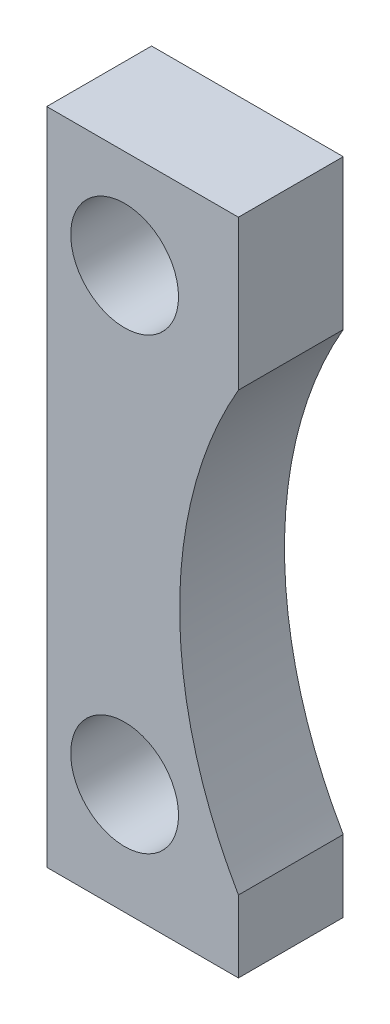
ISO-10303-21;
HEADER;
FILE_DESCRIPTION(('STEP AP214'),'2;1');
FILE_NAME('part.step','',(''),(''),'','','');
FILE_SCHEMA(('AUTOMOTIVE_DESIGN { 1 0 10303 214 1 1 1 1 }'));
ENDSEC;
DATA;
#1=APPLICATION_CONTEXT('core data for automotive mechanical design processes');
#2=APPLICATION_PROTOCOL_DEFINITION('international standard','automotive_design',2000,#1);
#3=PRODUCT_CONTEXT('',#1,'mechanical');
#4=PRODUCT('Part','Part','',(#3));
#5=PRODUCT_RELATED_PRODUCT_CATEGORY('part','',(#4));
#6=PRODUCT_DEFINITION_FORMATION('','',#4);
#7=PRODUCT_DEFINITION_CONTEXT('part definition',#1,'design');
#8=PRODUCT_DEFINITION('design','',#6,#7);
#9=PRODUCT_DEFINITION_SHAPE('','',#8);
#10=(LENGTH_UNIT() NAMED_UNIT(*) SI_UNIT(.MILLI.,.METRE.));
#11=(NAMED_UNIT(*) PLANE_ANGLE_UNIT() SI_UNIT($,.RADIAN.));
#12=(NAMED_UNIT(*) SI_UNIT($,.STERADIAN.) SOLID_ANGLE_UNIT());
#13=UNCERTAINTY_MEASURE_WITH_UNIT(LENGTH_MEASURE(1.E-05),#10,'distance_accuracy_value','');
#14=(GEOMETRIC_REPRESENTATION_CONTEXT(3) GLOBAL_UNCERTAINTY_ASSIGNED_CONTEXT((#13)) GLOBAL_UNIT_ASSIGNED_CONTEXT((#10,
#11,#12)) REPRESENTATION_CONTEXT('',''));
#15=CARTESIAN_POINT('',(0.,0.,0.));
#16=DIRECTION('',(0.,0.,1.));
#17=DIRECTION('',(1.,0.,0.));
#18=AXIS2_PLACEMENT_3D('',#15,#16,#17);
#19=CARTESIAN_POINT('',(0.,0.,8.75));
#20=DIRECTION('',(0.,1.,0.));
#21=DIRECTION('',(0.,0.,1.));
#22=AXIS2_PLACEMENT_3D('',#19,#20,#21);
#23=PLANE('',#22);
#24=DIRECTION('',(1.,0.,0.));
#25=VECTOR('',#24,1.);
#26=CARTESIAN_POINT('',(0.,0.,-8.75));
#27=LINE('',#26,#25);
#28=CARTESIAN_POINT('',(0.,0.,-8.75));
#29=VERTEX_POINT('',#28);
#30=CARTESIAN_POINT('',(32.,0.,-8.75));
#31=VERTEX_POINT('',#30);
#32=EDGE_CURVE('E118',#29,#31,#27,.T.);
#33=ORIENTED_EDGE('',*,*,#32,.T.);
#34=DIRECTION('',(0.,0.,-1.));
#35=VECTOR('',#34,1.);
#36=CARTESIAN_POINT('',(32.,0.,8.75));
#37=LINE('',#36,#35);
#38=CARTESIAN_POINT('',(32.,0.,8.75));
#39=VERTEX_POINT('',#38);
#40=EDGE_CURVE('E11',#39,#31,#37,.T.);
#41=ORIENTED_EDGE('',*,*,#40,.F.);
#42=DIRECTION('',(1.,0.,0.));
#43=VECTOR('',#42,1.);
#44=CARTESIAN_POINT('',(0.,0.,8.75));
#45=LINE('',#44,#43);
#46=CARTESIAN_POINT('',(0.,0.,8.75));
#47=VERTEX_POINT('',#46);
#48=EDGE_CURVE('E129',#47,#39,#45,.T.);
#49=ORIENTED_EDGE('',*,*,#48,.F.);
#50=DIRECTION('',(0.,0.,-1.));
#51=VECTOR('',#50,1.);
#52=CARTESIAN_POINT('',(0.,0.,8.75));
#53=LINE('',#52,#51);
#54=EDGE_CURVE('E114',#47,#29,#53,.T.);
#55=ORIENTED_EDGE('',*,*,#54,.T.);
#56=EDGE_LOOP('',(#33,#41,#49,#55));
#57=FACE_BOUND('',#56,.T.);
#58=ADVANCED_FACE('F34',(#57),#23,.F.);
#59=CARTESIAN_POINT('',(32.,0.,8.75));
#60=DIRECTION('',(-1.,0.,0.));
#61=DIRECTION('',(0.,-1.,0.));
#62=AXIS2_PLACEMENT_3D('',#59,#60,#61);
#63=PLANE('',#62);
#64=DIRECTION('',(0.,1.,0.));
#65=VECTOR('',#64,1.);
#66=CARTESIAN_POINT('',(32.,0.,-8.75));
#67=LINE('',#66,#65);
#68=CARTESIAN_POINT('',(32.,12.,-8.75));
#69=VERTEX_POINT('',#68);
#70=EDGE_CURVE('E121',#31,#69,#67,.T.);
#71=ORIENTED_EDGE('',*,*,#70,.T.);
#72=DIRECTION('',(0.,0.,-1.));
#73=VECTOR('',#72,1.);
#74=CARTESIAN_POINT('',(32.,12.,8.75));
#75=LINE('',#74,#73);
#76=CARTESIAN_POINT('',(32.,12.,8.75));
#77=VERTEX_POINT('',#76);
#78=EDGE_CURVE('E42',#77,#69,#75,.T.);
#79=ORIENTED_EDGE('',*,*,#78,.F.);
#80=DIRECTION('',(0.,1.,0.));
#81=VECTOR('',#80,1.);
#82=CARTESIAN_POINT('',(32.,0.,8.75));
#83=LINE('',#82,#81);
#84=EDGE_CURVE('E87',#39,#77,#83,.T.);
#85=ORIENTED_EDGE('',*,*,#84,.F.);
#86=ORIENTED_EDGE('',*,*,#40,.T.);
#87=EDGE_LOOP('',(#71,#79,#85,#86));
#88=FACE_BOUND('',#87,.T.);
#89=ADVANCED_FACE('F154',(#88),#63,.F.);
#90=CARTESIAN_POINT('',(95.,48.5,8.75));
#91=DIRECTION('',(0.,0.,-1.));
#92=DIRECTION('',(-1.,0.,0.));
#93=AXIS2_PLACEMENT_3D('',#90,#91,#92);
#94=CYLINDRICAL_SURFACE('',#93,72.8096834219185);
#95=CARTESIAN_POINT('',(95.,48.5,-8.75));
#96=DIRECTION('',(0.,0.,-1.));
#97=DIRECTION('',(-1.,0.,0.));
#98=AXIS2_PLACEMENT_3D('',#95,#96,#97);
#99=CIRCLE('',#98,72.8096834219185);
#100=CARTESIAN_POINT('',(32.,85.,-8.75));
#101=VERTEX_POINT('',#100);
#102=EDGE_CURVE('E124',#69,#101,#99,.T.);
#103=ORIENTED_EDGE('',*,*,#102,.T.);
#104=DIRECTION('',(0.,0.,-1.));
#105=VECTOR('',#104,1.);
#106=CARTESIAN_POINT('',(32.,85.,8.75));
#107=LINE('',#106,#105);
#108=CARTESIAN_POINT('',(32.,85.,8.75));
#109=VERTEX_POINT('',#108);
#110=EDGE_CURVE('E109',#109,#101,#107,.T.);
#111=ORIENTED_EDGE('',*,*,#110,.F.);
#112=CARTESIAN_POINT('',(95.,48.5,8.75));
#113=DIRECTION('',(0.,0.,-1.));
#114=DIRECTION('',(-1.,0.,0.));
#115=AXIS2_PLACEMENT_3D('',#112,#113,#114);
#116=CIRCLE('',#115,72.8096834219185);
#117=EDGE_CURVE('E100',#77,#109,#116,.T.);
#118=ORIENTED_EDGE('',*,*,#117,.F.);
#119=ORIENTED_EDGE('',*,*,#78,.T.);
#120=EDGE_LOOP('',(#103,#111,#118,#119));
#121=FACE_BOUND('',#120,.T.);
#122=ADVANCED_FACE('F135',(#121),#94,.F.);
#123=CARTESIAN_POINT('',(32.,110.,8.75));
#124=DIRECTION('',(-1.,0.,0.));
#125=DIRECTION('',(0.,-1.,0.));
#126=AXIS2_PLACEMENT_3D('',#123,#124,#125);
#127=PLANE('',#126);
#128=DIRECTION('',(0.,1.,0.));
#129=VECTOR('',#128,1.);
#130=CARTESIAN_POINT('',(32.,110.,-8.75));
#131=LINE('',#130,#129);
#132=CARTESIAN_POINT('',(32.,110.,-8.75));
#133=VERTEX_POINT('',#132);
#134=EDGE_CURVE('E108',#101,#133,#131,.T.);
#135=ORIENTED_EDGE('',*,*,#134,.T.);
#136=DIRECTION('',(0.,0.,-1.));
#137=VECTOR('',#136,1.);
#138=CARTESIAN_POINT('',(32.,110.,8.75));
#139=LINE('',#138,#137);
#140=CARTESIAN_POINT('',(32.,110.,8.75));
#141=VERTEX_POINT('',#140);
#142=EDGE_CURVE('E105',#141,#133,#139,.T.);
#143=ORIENTED_EDGE('',*,*,#142,.F.);
#144=DIRECTION('',(0.,1.,0.));
#145=VECTOR('',#144,1.);
#146=CARTESIAN_POINT('',(32.,110.,8.75));
#147=LINE('',#146,#145);
#148=EDGE_CURVE('E94',#109,#141,#147,.T.);
#149=ORIENTED_EDGE('',*,*,#148,.F.);
#150=ORIENTED_EDGE('',*,*,#110,.T.);
#151=EDGE_LOOP('',(#135,#143,#149,#150));
#152=FACE_BOUND('',#151,.T.);
#153=ADVANCED_FACE('F106',(#152),#127,.F.);
#154=CARTESIAN_POINT('',(0.,110.,8.75));
#155=DIRECTION('',(0.,-1.,0.));
#156=DIRECTION('',(0.,0.,-1.));
#157=AXIS2_PLACEMENT_3D('',#154,#155,#156);
#158=PLANE('',#157);
#159=DIRECTION('',(-1.,0.,0.));
#160=VECTOR('',#159,1.);
#161=CARTESIAN_POINT('',(0.,110.,-8.75));
#162=LINE('',#161,#160);
#163=CARTESIAN_POINT('',(0.,110.,-8.75));
#164=VERTEX_POINT('',#163);
#165=EDGE_CURVE('E73',#133,#164,#162,.T.);
#166=ORIENTED_EDGE('',*,*,#165,.T.);
#167=DIRECTION('',(0.,0.,-1.));
#168=VECTOR('',#167,1.);
#169=CARTESIAN_POINT('',(0.,110.,8.75));
#170=LINE('',#169,#168);
#171=CARTESIAN_POINT('',(0.,110.,8.75));
#172=VERTEX_POINT('',#171);
#173=EDGE_CURVE('E110',#172,#164,#170,.T.);
#174=ORIENTED_EDGE('',*,*,#173,.F.);
#175=DIRECTION('',(-1.,0.,0.));
#176=VECTOR('',#175,1.);
#177=CARTESIAN_POINT('',(0.,110.,8.75));
#178=LINE('',#177,#176);
#179=EDGE_CURVE('E98',#141,#172,#178,.T.);
#180=ORIENTED_EDGE('',*,*,#179,.F.);
#181=ORIENTED_EDGE('',*,*,#142,.T.);
#182=EDGE_LOOP('',(#166,#174,#180,#181));
#183=FACE_BOUND('',#182,.T.);
#184=ADVANCED_FACE('F112',(#183),#158,.F.);
#185=CARTESIAN_POINT('',(0.,0.,8.75));
#186=DIRECTION('',(1.,0.,0.));
#187=DIRECTION('',(0.,0.,-1.));
#188=AXIS2_PLACEMENT_3D('',#185,#186,#187);
#189=PLANE('',#188);
#190=DIRECTION('',(0.,-1.,0.));
#191=VECTOR('',#190,1.);
#192=CARTESIAN_POINT('',(0.,0.,-8.75));
#193=LINE('',#192,#191);
#194=EDGE_CURVE('E79',#164,#29,#193,.T.);
#195=ORIENTED_EDGE('',*,*,#194,.T.);
#196=ORIENTED_EDGE('',*,*,#54,.F.);
#197=DIRECTION('',(0.,-1.,0.));
#198=VECTOR('',#197,1.);
#199=CARTESIAN_POINT('',(0.,0.,8.75));
#200=LINE('',#199,#198);
#201=EDGE_CURVE('E50',#172,#47,#200,.T.);
#202=ORIENTED_EDGE('',*,*,#201,.F.);
#203=ORIENTED_EDGE('',*,*,#173,.T.);
#204=EDGE_LOOP('',(#195,#196,#202,#203));
#205=FACE_BOUND('',#204,.T.);
#206=ADVANCED_FACE('F142',(#205),#189,.F.);
#207=CARTESIAN_POINT('',(95.,48.5,8.75));
#208=DIRECTION('',(0.,0.,-1.));
#209=DIRECTION('',(-1.,0.,0.));
#210=AXIS2_PLACEMENT_3D('',#207,#208,#209);
#211=PLANE('',#210);
#212=CARTESIAN_POINT('',(13.,93.5,8.75));
#213=DIRECTION('',(0.,0.,1.));
#214=DIRECTION('',(1.,0.,0.));
#215=AXIS2_PLACEMENT_3D('',#212,#213,#214);
#216=CIRCLE('',#215,9.00000000000002);
#217=CARTESIAN_POINT('',(22.0000000000001,93.5,8.75));
#218=VERTEX_POINT('',#217);
#219=EDGE_CURVE('E219',#218,#218,#216,.T.);
#220=ORIENTED_EDGE('',*,*,#219,.F.);
#221=EDGE_LOOP('',(#220));
#222=FACE_BOUND('',#221,.T.);
#223=CARTESIAN_POINT('',(13.0000000000001,18.5,8.75));
#224=DIRECTION('',(0.,0.,1.));
#225=DIRECTION('',(1.,0.,0.));
#226=AXIS2_PLACEMENT_3D('',#223,#224,#225);
#227=CIRCLE('',#226,9.);
#228=CARTESIAN_POINT('',(22.0000000000001,18.5,8.75));
#229=VERTEX_POINT('',#228);
#230=EDGE_CURVE('E224',#229,#229,#227,.T.);
#231=ORIENTED_EDGE('',*,*,#230,.F.);
#232=EDGE_LOOP('',(#231));
#233=FACE_BOUND('',#232,.T.);
#234=ORIENTED_EDGE('',*,*,#48,.T.);
#235=ORIENTED_EDGE('',*,*,#84,.T.);
#236=ORIENTED_EDGE('',*,*,#117,.T.);
#237=ORIENTED_EDGE('',*,*,#148,.T.);
#238=ORIENTED_EDGE('',*,*,#179,.T.);
#239=ORIENTED_EDGE('',*,*,#201,.T.);
#240=EDGE_LOOP('',(#234,#235,#236,#237,#238,#239));
#241=FACE_BOUND('',#240,.T.);
#242=ADVANCED_FACE('F96',(#222,#233,#241),#211,.F.);
#243=CARTESIAN_POINT('',(95.,48.5,-8.75));
#244=DIRECTION('',(0.,0.,-1.));
#245=DIRECTION('',(-1.,0.,0.));
#246=AXIS2_PLACEMENT_3D('',#243,#244,#245);
#247=PLANE('',#246);
#248=CARTESIAN_POINT('',(13.,93.5,-8.75));
#249=DIRECTION('',(0.,0.,1.));
#250=DIRECTION('',(1.,0.,0.));
#251=AXIS2_PLACEMENT_3D('',#248,#249,#250);
#252=CIRCLE('',#251,9.00000000000002);
#253=CARTESIAN_POINT('',(22.0000000000001,93.5,-8.75));
#254=VERTEX_POINT('',#253);
#255=EDGE_CURVE('E122',#254,#254,#252,.T.);
#256=ORIENTED_EDGE('',*,*,#255,.T.);
#257=EDGE_LOOP('',(#256));
#258=FACE_BOUND('',#257,.T.);
#259=CARTESIAN_POINT('',(13.0000000000001,18.5,-8.75));
#260=DIRECTION('',(0.,0.,1.));
#261=DIRECTION('',(1.,0.,0.));
#262=AXIS2_PLACEMENT_3D('',#259,#260,#261);
#263=CIRCLE('',#262,9.);
#264=CARTESIAN_POINT('',(22.0000000000001,18.5,-8.75));
#265=VERTEX_POINT('',#264);
#266=EDGE_CURVE('E220',#265,#265,#263,.T.);
#267=ORIENTED_EDGE('',*,*,#266,.T.);
#268=EDGE_LOOP('',(#267));
#269=FACE_BOUND('',#268,.T.);
#270=ORIENTED_EDGE('',*,*,#32,.F.);
#271=ORIENTED_EDGE('',*,*,#194,.F.);
#272=ORIENTED_EDGE('',*,*,#165,.F.);
#273=ORIENTED_EDGE('',*,*,#134,.F.);
#274=ORIENTED_EDGE('',*,*,#102,.F.);
#275=ORIENTED_EDGE('',*,*,#70,.F.);
#276=EDGE_LOOP('',(#270,#271,#272,#273,#274,#275));
#277=FACE_BOUND('',#276,.T.);
#278=ADVANCED_FACE('F138',(#258,#269,#277),#247,.T.);
#279=CARTESIAN_POINT('',(13.0000000000001,18.5,-8.75));
#280=DIRECTION('',(0.,0.,1.));
#281=DIRECTION('',(1.,0.,0.));
#282=AXIS2_PLACEMENT_3D('',#279,#280,#281);
#283=CYLINDRICAL_SURFACE('',#282,9.);
#284=ORIENTED_EDGE('',*,*,#266,.F.);
#285=EDGE_LOOP('',(#284));
#286=FACE_BOUND('',#285,.T.);
#287=ORIENTED_EDGE('',*,*,#230,.T.);
#288=EDGE_LOOP('',(#287));
#289=FACE_BOUND('',#288,.T.);
#290=ADVANCED_FACE('F191',(#286,#289),#283,.F.);
#291=CARTESIAN_POINT('',(13.,93.5,-8.75));
#292=DIRECTION('',(0.,0.,1.));
#293=DIRECTION('',(1.,0.,0.));
#294=AXIS2_PLACEMENT_3D('',#291,#292,#293);
#295=CYLINDRICAL_SURFACE('',#294,9.00000000000002);
#296=ORIENTED_EDGE('',*,*,#255,.F.);
#297=EDGE_LOOP('',(#296));
#298=FACE_BOUND('',#297,.T.);
#299=ORIENTED_EDGE('',*,*,#219,.T.);
#300=EDGE_LOOP('',(#299));
#301=FACE_BOUND('',#300,.T.);
#302=ADVANCED_FACE('F200',(#298,#301),#295,.F.);
#303=CLOSED_SHELL('',(#58,#89,#122,#153,#184,#206,#242,#278,#290,#302));
#304=MANIFOLD_SOLID_BREP('B2',#303);
#305=ADVANCED_BREP_SHAPE_REPRESENTATION('',(#18,#304),#14);
#306=SHAPE_DEFINITION_REPRESENTATION(#9,#305);
ENDSEC;
END-ISO-10303-21;
